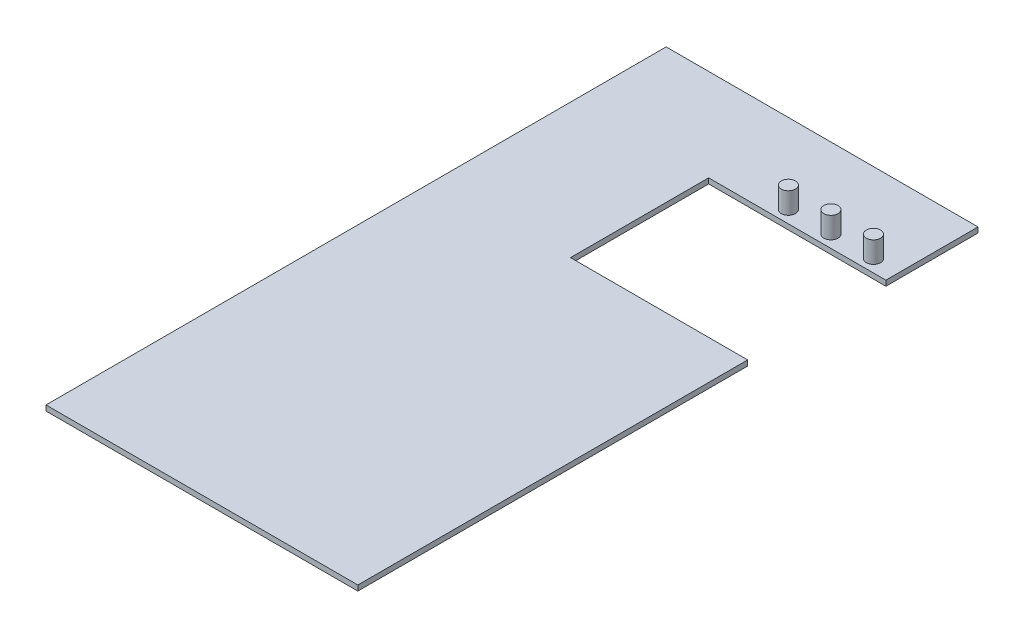
ISO-10303-21;
HEADER;
FILE_DESCRIPTION(('STEP AP214'),'2;1');
FILE_NAME('part.step','',(''),(''),'','','');
FILE_SCHEMA(('AUTOMOTIVE_DESIGN { 1 0 10303 214 1 1 1 1 }'));
ENDSEC;
DATA;
#1=APPLICATION_CONTEXT('core data for automotive mechanical design processes');
#2=APPLICATION_PROTOCOL_DEFINITION('international standard','automotive_design',2000,#1);
#3=PRODUCT_CONTEXT('',#1,'mechanical');
#4=PRODUCT('Part','Part','',(#3));
#5=PRODUCT_RELATED_PRODUCT_CATEGORY('part','',(#4));
#6=PRODUCT_DEFINITION_FORMATION('','',#4);
#7=PRODUCT_DEFINITION_CONTEXT('part definition',#1,'design');
#8=PRODUCT_DEFINITION('design','',#6,#7);
#9=PRODUCT_DEFINITION_SHAPE('','',#8);
#10=(LENGTH_UNIT() NAMED_UNIT(*) SI_UNIT(.MILLI.,.METRE.));
#11=(NAMED_UNIT(*) PLANE_ANGLE_UNIT() SI_UNIT($,.RADIAN.));
#12=(NAMED_UNIT(*) SI_UNIT($,.STERADIAN.) SOLID_ANGLE_UNIT());
#13=UNCERTAINTY_MEASURE_WITH_UNIT(LENGTH_MEASURE(1.E-05),#10,'distance_accuracy_value','');
#14=(GEOMETRIC_REPRESENTATION_CONTEXT(3) GLOBAL_UNCERTAINTY_ASSIGNED_CONTEXT((#13)) GLOBAL_UNIT_ASSIGNED_CONTEXT((#10,
#11,#12)) REPRESENTATION_CONTEXT('',''));
#15=CARTESIAN_POINT('',(0.,0.,0.));
#16=DIRECTION('',(0.,0.,1.));
#17=DIRECTION('',(1.,0.,0.));
#18=AXIS2_PLACEMENT_3D('',#15,#16,#17);
#19=CARTESIAN_POINT('',(44.,1.5,-87.5));
#20=DIRECTION('',(-1.,0.,0.));
#21=DIRECTION('',(0.,0.,1.));
#22=AXIS2_PLACEMENT_3D('',#19,#20,#21);
#23=PLANE('',#22);
#24=DIRECTION('',(0.,0.,-1.));
#25=VECTOR('',#24,1.);
#26=CARTESIAN_POINT('',(44.,0.,-87.5));
#27=LINE('',#26,#25);
#28=CARTESIAN_POINT('',(44.,0.,87.5));
#29=VERTEX_POINT('',#28);
#30=CARTESIAN_POINT('',(44.,0.,-22.5));
#31=VERTEX_POINT('',#30);
#32=EDGE_CURVE('E136',#29,#31,#27,.T.);
#33=ORIENTED_EDGE('',*,*,#32,.T.);
#34=DIRECTION('',(0.,1.,0.));
#35=VECTOR('',#34,1.);
#36=CARTESIAN_POINT('',(44.,0.,-22.5));
#37=LINE('',#36,#35);
#38=CARTESIAN_POINT('',(44.,1.5,-22.5));
#39=VERTEX_POINT('',#38);
#40=EDGE_CURVE('E181',#31,#39,#37,.T.);
#41=ORIENTED_EDGE('',*,*,#40,.T.);
#42=DIRECTION('',(0.,0.,-1.));
#43=VECTOR('',#42,1.);
#44=CARTESIAN_POINT('',(44.,1.5,-87.5));
#45=LINE('',#44,#43);
#46=CARTESIAN_POINT('',(44.,1.5,87.5));
#47=VERTEX_POINT('',#46);
#48=EDGE_CURVE('E172',#47,#39,#45,.T.);
#49=ORIENTED_EDGE('',*,*,#48,.F.);
#50=DIRECTION('',(0.,-1.,0.));
#51=VECTOR('',#50,1.);
#52=CARTESIAN_POINT('',(44.,1.5,87.5));
#53=LINE('',#52,#51);
#54=EDGE_CURVE('E150',#47,#29,#53,.T.);
#55=ORIENTED_EDGE('',*,*,#54,.T.);
#56=EDGE_LOOP('',(#33,#41,#49,#55));
#57=FACE_BOUND('',#56,.T.);
#58=ADVANCED_FACE('F40',(#57),#23,.F.);
#59=CARTESIAN_POINT('',(-44.,1.5,-87.5));
#60=DIRECTION('',(1.,0.,0.));
#61=DIRECTION('',(0.,0.,-1.));
#62=AXIS2_PLACEMENT_3D('',#59,#60,#61);
#63=PLANE('',#62);
#64=DIRECTION('',(0.,0.,1.));
#65=VECTOR('',#64,1.);
#66=CARTESIAN_POINT('',(-44.,0.,-87.5));
#67=LINE('',#66,#65);
#68=CARTESIAN_POINT('',(-44.,0.,-87.5));
#69=VERTEX_POINT('',#68);
#70=CARTESIAN_POINT('',(-44.,0.,87.5));
#71=VERTEX_POINT('',#70);
#72=EDGE_CURVE('E140',#69,#71,#67,.T.);
#73=ORIENTED_EDGE('',*,*,#72,.T.);
#74=DIRECTION('',(0.,-1.,0.));
#75=VECTOR('',#74,1.);
#76=CARTESIAN_POINT('',(-44.,1.5,87.5));
#77=LINE('',#76,#75);
#78=CARTESIAN_POINT('',(-44.,1.5,87.5));
#79=VERTEX_POINT('',#78);
#80=EDGE_CURVE('E153',#79,#71,#77,.T.);
#81=ORIENTED_EDGE('',*,*,#80,.F.);
#82=DIRECTION('',(0.,0.,1.));
#83=VECTOR('',#82,1.);
#84=CARTESIAN_POINT('',(-44.,1.5,-87.5));
#85=LINE('',#84,#83);
#86=CARTESIAN_POINT('',(-44.,1.5,-87.5));
#87=VERTEX_POINT('',#86);
#88=EDGE_CURVE('E145',#87,#79,#85,.T.);
#89=ORIENTED_EDGE('',*,*,#88,.F.);
#90=DIRECTION('',(0.,-1.,0.));
#91=VECTOR('',#90,1.);
#92=CARTESIAN_POINT('',(-44.,1.5,-87.5));
#93=LINE('',#92,#91);
#94=EDGE_CURVE('E146',#87,#69,#93,.T.);
#95=ORIENTED_EDGE('',*,*,#94,.T.);
#96=EDGE_LOOP('',(#73,#81,#89,#95));
#97=FACE_BOUND('',#96,.T.);
#98=ADVANCED_FACE('F42',(#97),#63,.F.);
#99=CARTESIAN_POINT('',(44.,1.5,87.5));
#100=DIRECTION('',(0.,0.,-1.));
#101=DIRECTION('',(-1.,0.,0.));
#102=AXIS2_PLACEMENT_3D('',#99,#100,#101);
#103=PLANE('',#102);
#104=DIRECTION('',(1.,0.,0.));
#105=VECTOR('',#104,1.);
#106=CARTESIAN_POINT('',(44.,0.,87.5));
#107=LINE('',#106,#105);
#108=EDGE_CURVE('E137',#71,#29,#107,.T.);
#109=ORIENTED_EDGE('',*,*,#108,.T.);
#110=ORIENTED_EDGE('',*,*,#54,.F.);
#111=DIRECTION('',(1.,0.,0.));
#112=VECTOR('',#111,1.);
#113=CARTESIAN_POINT('',(44.,1.5,87.5));
#114=LINE('',#113,#112);
#115=EDGE_CURVE('E93',#79,#47,#114,.T.);
#116=ORIENTED_EDGE('',*,*,#115,.F.);
#117=ORIENTED_EDGE('',*,*,#80,.T.);
#118=EDGE_LOOP('',(#109,#110,#116,#117));
#119=FACE_BOUND('',#118,.T.);
#120=ADVANCED_FACE('F191',(#119),#103,.F.);
#121=CARTESIAN_POINT('',(44.,1.5,-61.5));
#122=VERTEX_POINT('',#121);
#123=CARTESIAN_POINT('',(44.,1.5,-87.5));
#124=VERTEX_POINT('',#123);
#125=EDGE_CURVE('E130',#122,#124,#45,.T.);
#126=ORIENTED_EDGE('',*,*,#125,.F.);
#127=DIRECTION('',(0.,1.,0.));
#128=VECTOR('',#127,1.);
#129=CARTESIAN_POINT('',(44.,0.,-61.5));
#130=LINE('',#129,#128);
#131=CARTESIAN_POINT('',(44.,0.,-61.5));
#132=VERTEX_POINT('',#131);
#133=EDGE_CURVE('E118',#132,#122,#130,.T.);
#134=ORIENTED_EDGE('',*,*,#133,.F.);
#135=CARTESIAN_POINT('',(44.,0.,-87.5));
#136=VERTEX_POINT('',#135);
#137=EDGE_CURVE('E129',#132,#136,#27,.T.);
#138=ORIENTED_EDGE('',*,*,#137,.T.);
#139=DIRECTION('',(0.,-1.,0.));
#140=VECTOR('',#139,1.);
#141=CARTESIAN_POINT('',(44.,1.5,-87.5));
#142=LINE('',#141,#140);
#143=EDGE_CURVE('E148',#124,#136,#142,.T.);
#144=ORIENTED_EDGE('',*,*,#143,.F.);
#145=EDGE_LOOP('',(#126,#134,#138,#144));
#146=FACE_BOUND('',#145,.T.);
#147=ADVANCED_FACE('F127',(#146),#23,.F.);
#148=CARTESIAN_POINT('',(44.,1.5,-87.5));
#149=DIRECTION('',(0.,0.,1.));
#150=DIRECTION('',(1.,0.,0.));
#151=AXIS2_PLACEMENT_3D('',#148,#149,#150);
#152=PLANE('',#151);
#153=DIRECTION('',(-1.,0.,0.));
#154=VECTOR('',#153,1.);
#155=CARTESIAN_POINT('',(44.,0.,-87.5));
#156=LINE('',#155,#154);
#157=EDGE_CURVE('E85',#136,#69,#156,.T.);
#158=ORIENTED_EDGE('',*,*,#157,.T.);
#159=ORIENTED_EDGE('',*,*,#94,.F.);
#160=DIRECTION('',(-1.,0.,0.));
#161=VECTOR('',#160,1.);
#162=CARTESIAN_POINT('',(44.,1.5,-87.5));
#163=LINE('',#162,#161);
#164=EDGE_CURVE('E64',#124,#87,#163,.T.);
#165=ORIENTED_EDGE('',*,*,#164,.F.);
#166=ORIENTED_EDGE('',*,*,#143,.T.);
#167=EDGE_LOOP('',(#158,#159,#165,#166));
#168=FACE_BOUND('',#167,.T.);
#169=ADVANCED_FACE('F165',(#168),#152,.F.);
#170=CARTESIAN_POINT('',(0.,1.5,0.));
#171=DIRECTION('',(0.,-1.,0.));
#172=DIRECTION('',(0.,0.,-1.));
#173=AXIS2_PLACEMENT_3D('',#170,#171,#172);
#174=PLANE('',#173);
#175=CARTESIAN_POINT('',(13.,1.5,-65.));
#176=DIRECTION('',(0.,-1.,0.));
#177=DIRECTION('',(0.,0.,-1.));
#178=AXIS2_PLACEMENT_3D('',#175,#176,#177);
#179=CIRCLE('',#178,2.);
#180=CARTESIAN_POINT('',(13.,1.5,-67.));
#181=VERTEX_POINT('',#180);
#182=EDGE_CURVE('E11',#181,#181,#179,.F.);
#183=ORIENTED_EDGE('',*,*,#182,.F.);
#184=EDGE_LOOP('',(#183));
#185=FACE_BOUND('',#184,.T.);
#186=CARTESIAN_POINT('',(25.,1.5,-65.));
#187=DIRECTION('',(0.,-1.,0.));
#188=DIRECTION('',(0.,0.,-1.));
#189=AXIS2_PLACEMENT_3D('',#186,#187,#188);
#190=CIRCLE('',#189,2.00000000000001);
#191=CARTESIAN_POINT('',(25.,1.5,-67.));
#192=VERTEX_POINT('',#191);
#193=EDGE_CURVE('E48',#192,#192,#190,.F.);
#194=ORIENTED_EDGE('',*,*,#193,.F.);
#195=EDGE_LOOP('',(#194));
#196=FACE_BOUND('',#195,.T.);
#197=CARTESIAN_POINT('',(37.,1.5,-65.));
#198=DIRECTION('',(0.,-1.,0.));
#199=DIRECTION('',(0.,0.,-1.));
#200=AXIS2_PLACEMENT_3D('',#197,#198,#199);
#201=CIRCLE('',#200,2.);
#202=CARTESIAN_POINT('',(37.,1.5,-67.));
#203=VERTEX_POINT('',#202);
#204=EDGE_CURVE('E155',#203,#203,#201,.F.);
#205=ORIENTED_EDGE('',*,*,#204,.F.);
#206=EDGE_LOOP('',(#205));
#207=FACE_BOUND('',#206,.T.);
#208=ORIENTED_EDGE('',*,*,#48,.T.);
#209=DIRECTION('',(1.,0.,0.));
#210=VECTOR('',#209,1.);
#211=CARTESIAN_POINT('',(44.,1.5,-22.5));
#212=LINE('',#211,#210);
#213=CARTESIAN_POINT('',(-5.99999999999999,1.5,-22.5));
#214=VERTEX_POINT('',#213);
#215=EDGE_CURVE('E123',#214,#39,#212,.T.);
#216=ORIENTED_EDGE('',*,*,#215,.F.);
#217=DIRECTION('',(0.,0.,1.));
#218=VECTOR('',#217,1.);
#219=CARTESIAN_POINT('',(-5.99999999999999,1.5,-22.5));
#220=LINE('',#219,#218);
#221=CARTESIAN_POINT('',(-5.99999999999999,1.5,-61.5));
#222=VERTEX_POINT('',#221);
#223=EDGE_CURVE('E199',#222,#214,#220,.T.);
#224=ORIENTED_EDGE('',*,*,#223,.F.);
#225=DIRECTION('',(-1.,0.,0.));
#226=VECTOR('',#225,1.);
#227=CARTESIAN_POINT('',(44.,1.5,-61.5));
#228=LINE('',#227,#226);
#229=EDGE_CURVE('E198',#122,#222,#228,.T.);
#230=ORIENTED_EDGE('',*,*,#229,.F.);
#231=ORIENTED_EDGE('',*,*,#125,.T.);
#232=ORIENTED_EDGE('',*,*,#164,.T.);
#233=ORIENTED_EDGE('',*,*,#88,.T.);
#234=ORIENTED_EDGE('',*,*,#115,.T.);
#235=EDGE_LOOP('',(#208,#216,#224,#230,#231,#232,#233,#234));
#236=FACE_BOUND('',#235,.T.);
#237=ADVANCED_FACE('F162',(#185,#196,#207,#236),#174,.F.);
#238=CARTESIAN_POINT('',(0.,0.,0.));
#239=DIRECTION('',(0.,-1.,0.));
#240=DIRECTION('',(0.,0.,-1.));
#241=AXIS2_PLACEMENT_3D('',#238,#239,#240);
#242=PLANE('',#241);
#243=DIRECTION('',(1.,0.,0.));
#244=VECTOR('',#243,1.);
#245=CARTESIAN_POINT('',(44.,0.,-22.5));
#246=LINE('',#245,#244);
#247=CARTESIAN_POINT('',(-5.99999999999999,0.,-22.5));
#248=VERTEX_POINT('',#247);
#249=EDGE_CURVE('E131',#248,#31,#246,.T.);
#250=ORIENTED_EDGE('',*,*,#249,.T.);
#251=ORIENTED_EDGE('',*,*,#32,.F.);
#252=ORIENTED_EDGE('',*,*,#108,.F.);
#253=ORIENTED_EDGE('',*,*,#72,.F.);
#254=ORIENTED_EDGE('',*,*,#157,.F.);
#255=ORIENTED_EDGE('',*,*,#137,.F.);
#256=DIRECTION('',(-1.,0.,0.));
#257=VECTOR('',#256,1.);
#258=CARTESIAN_POINT('',(44.,0.,-61.5));
#259=LINE('',#258,#257);
#260=CARTESIAN_POINT('',(-5.99999999999999,0.,-61.5));
#261=VERTEX_POINT('',#260);
#262=EDGE_CURVE('E114',#132,#261,#259,.T.);
#263=ORIENTED_EDGE('',*,*,#262,.T.);
#264=DIRECTION('',(0.,0.,1.));
#265=VECTOR('',#264,1.);
#266=CARTESIAN_POINT('',(-5.99999999999999,0.,-22.5));
#267=LINE('',#266,#265);
#268=EDGE_CURVE('E55',#261,#248,#267,.T.);
#269=ORIENTED_EDGE('',*,*,#268,.T.);
#270=EDGE_LOOP('',(#250,#251,#252,#253,#254,#255,#263,#269));
#271=FACE_BOUND('',#270,.T.);
#272=ADVANCED_FACE('F134',(#271),#242,.T.);
#273=CARTESIAN_POINT('',(44.,0.,-22.5));
#274=DIRECTION('',(0.,0.,1.));
#275=DIRECTION('',(1.,0.,0.));
#276=AXIS2_PLACEMENT_3D('',#273,#274,#275);
#277=PLANE('',#276);
#278=ORIENTED_EDGE('',*,*,#215,.T.);
#279=ORIENTED_EDGE('',*,*,#40,.F.);
#280=ORIENTED_EDGE('',*,*,#249,.F.);
#281=DIRECTION('',(0.,1.,0.));
#282=VECTOR('',#281,1.);
#283=CARTESIAN_POINT('',(-5.99999999999999,0.,-22.5));
#284=LINE('',#283,#282);
#285=EDGE_CURVE('E184',#248,#214,#284,.T.);
#286=ORIENTED_EDGE('',*,*,#285,.T.);
#287=EDGE_LOOP('',(#278,#279,#280,#286));
#288=FACE_BOUND('',#287,.T.);
#289=ADVANCED_FACE('F202',(#288),#277,.F.);
#290=CARTESIAN_POINT('',(-5.99999999999999,0.,-22.5));
#291=DIRECTION('',(-1.,0.,0.));
#292=DIRECTION('',(0.,0.,1.));
#293=AXIS2_PLACEMENT_3D('',#290,#291,#292);
#294=PLANE('',#293);
#295=ORIENTED_EDGE('',*,*,#223,.T.);
#296=ORIENTED_EDGE('',*,*,#285,.F.);
#297=ORIENTED_EDGE('',*,*,#268,.F.);
#298=DIRECTION('',(0.,1.,0.));
#299=VECTOR('',#298,1.);
#300=CARTESIAN_POINT('',(-5.99999999999999,0.,-61.5));
#301=LINE('',#300,#299);
#302=EDGE_CURVE('E120',#261,#222,#301,.T.);
#303=ORIENTED_EDGE('',*,*,#302,.T.);
#304=EDGE_LOOP('',(#295,#296,#297,#303));
#305=FACE_BOUND('',#304,.T.);
#306=ADVANCED_FACE('F203',(#305),#294,.F.);
#307=CARTESIAN_POINT('',(44.,0.,-61.5));
#308=DIRECTION('',(0.,0.,-1.));
#309=DIRECTION('',(-1.,0.,0.));
#310=AXIS2_PLACEMENT_3D('',#307,#308,#309);
#311=PLANE('',#310);
#312=ORIENTED_EDGE('',*,*,#229,.T.);
#313=ORIENTED_EDGE('',*,*,#302,.F.);
#314=ORIENTED_EDGE('',*,*,#262,.F.);
#315=ORIENTED_EDGE('',*,*,#133,.T.);
#316=EDGE_LOOP('',(#312,#313,#314,#315));
#317=FACE_BOUND('',#316,.T.);
#318=ADVANCED_FACE('F117',(#317),#311,.F.);
#319=CARTESIAN_POINT('',(37.,7.5,-65.));
#320=DIRECTION('',(0.,-1.,0.));
#321=DIRECTION('',(0.,0.,-1.));
#322=AXIS2_PLACEMENT_3D('',#319,#320,#321);
#323=CYLINDRICAL_SURFACE('',#322,2.);
#324=CARTESIAN_POINT('',(37.,7.5,-65.));
#325=DIRECTION('',(0.,1.,0.));
#326=DIRECTION('',(0.,0.,1.));
#327=AXIS2_PLACEMENT_3D('',#324,#325,#326);
#328=CIRCLE('',#327,2.);
#329=CARTESIAN_POINT('',(37.,7.5,-63.));
#330=VERTEX_POINT('',#329);
#331=EDGE_CURVE('E200',#330,#330,#328,.T.);
#332=ORIENTED_EDGE('',*,*,#331,.F.);
#333=EDGE_LOOP('',(#332));
#334=FACE_BOUND('',#333,.T.);
#335=ORIENTED_EDGE('',*,*,#204,.T.);
#336=EDGE_LOOP('',(#335));
#337=FACE_BOUND('',#336,.T.);
#338=ADVANCED_FACE('F210',(#334,#337),#323,.T.);
#339=CARTESIAN_POINT('',(37.,7.5,-65.));
#340=DIRECTION('',(0.,1.,0.));
#341=DIRECTION('',(0.,0.,1.));
#342=AXIS2_PLACEMENT_3D('',#339,#340,#341);
#343=PLANE('',#342);
#344=ORIENTED_EDGE('',*,*,#331,.T.);
#345=EDGE_LOOP('',(#344));
#346=FACE_BOUND('',#345,.T.);
#347=ADVANCED_FACE('F299',(#346),#343,.T.);
#348=CARTESIAN_POINT('',(25.,7.5,-65.));
#349=DIRECTION('',(0.,-1.,0.));
#350=DIRECTION('',(0.,0.,-1.));
#351=AXIS2_PLACEMENT_3D('',#348,#349,#350);
#352=CYLINDRICAL_SURFACE('',#351,2.00000000000001);
#353=CARTESIAN_POINT('',(25.,7.5,-65.));
#354=DIRECTION('',(0.,1.,0.));
#355=DIRECTION('',(0.,0.,1.));
#356=AXIS2_PLACEMENT_3D('',#353,#354,#355);
#357=CIRCLE('',#356,2.00000000000001);
#358=CARTESIAN_POINT('',(25.,7.5,-63.));
#359=VERTEX_POINT('',#358);
#360=EDGE_CURVE('E382',#359,#359,#357,.T.);
#361=ORIENTED_EDGE('',*,*,#360,.F.);
#362=EDGE_LOOP('',(#361));
#363=FACE_BOUND('',#362,.T.);
#364=ORIENTED_EDGE('',*,*,#193,.T.);
#365=EDGE_LOOP('',(#364));
#366=FACE_BOUND('',#365,.T.);
#367=ADVANCED_FACE('F160',(#363,#366),#352,.T.);
#368=CARTESIAN_POINT('',(25.,7.5,-65.));
#369=DIRECTION('',(0.,1.,0.));
#370=DIRECTION('',(0.,0.,1.));
#371=AXIS2_PLACEMENT_3D('',#368,#369,#370);
#372=PLANE('',#371);
#373=ORIENTED_EDGE('',*,*,#360,.T.);
#374=EDGE_LOOP('',(#373));
#375=FACE_BOUND('',#374,.T.);
#376=ADVANCED_FACE('F322',(#375),#372,.T.);
#377=CARTESIAN_POINT('',(13.,7.5,-65.));
#378=DIRECTION('',(0.,-1.,0.));
#379=DIRECTION('',(0.,0.,-1.));
#380=AXIS2_PLACEMENT_3D('',#377,#378,#379);
#381=CYLINDRICAL_SURFACE('',#380,2.);
#382=CARTESIAN_POINT('',(13.,7.5,-65.));
#383=DIRECTION('',(0.,1.,0.));
#384=DIRECTION('',(0.,0.,1.));
#385=AXIS2_PLACEMENT_3D('',#382,#383,#384);
#386=CIRCLE('',#385,2.);
#387=CARTESIAN_POINT('',(13.,7.5,-63.));
#388=VERTEX_POINT('',#387);
#389=EDGE_CURVE('E381',#388,#388,#386,.T.);
#390=ORIENTED_EDGE('',*,*,#389,.F.);
#391=EDGE_LOOP('',(#390));
#392=FACE_BOUND('',#391,.T.);
#393=ORIENTED_EDGE('',*,*,#182,.T.);
#394=EDGE_LOOP('',(#393));
#395=FACE_BOUND('',#394,.T.);
#396=ADVANCED_FACE('F334',(#392,#395),#381,.T.);
#397=CARTESIAN_POINT('',(13.,7.5,-65.));
#398=DIRECTION('',(0.,1.,0.));
#399=DIRECTION('',(0.,0.,1.));
#400=AXIS2_PLACEMENT_3D('',#397,#398,#399);
#401=PLANE('',#400);
#402=ORIENTED_EDGE('',*,*,#389,.T.);
#403=EDGE_LOOP('',(#402));
#404=FACE_BOUND('',#403,.T.);
#405=ADVANCED_FACE('F346',(#404),#401,.T.);
#406=CLOSED_SHELL('',(#58,#98,#120,#147,#169,#237,#272,#289,#306,#318,#338,#347,#367,#376,#396,#405));
#407=MANIFOLD_SOLID_BREP('B2',#406);
#408=ADVANCED_BREP_SHAPE_REPRESENTATION('',(#18,#407),#14);
#409=SHAPE_DEFINITION_REPRESENTATION(#9,#408);
ENDSEC;
END-ISO-10303-21;
